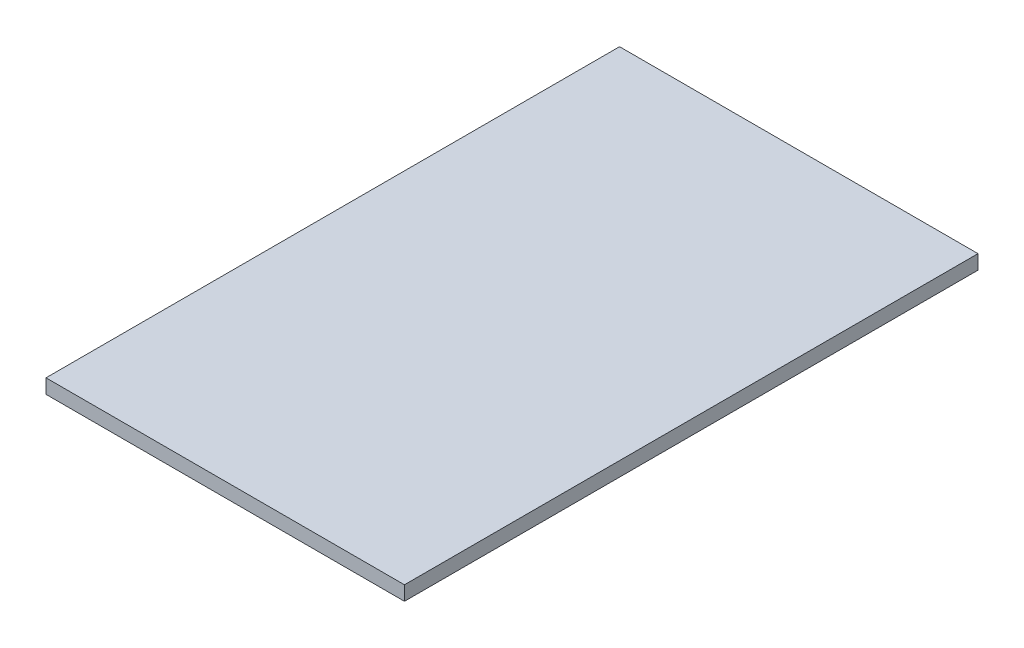
ISO-10303-21;
HEADER;
FILE_DESCRIPTION(('STEP AP214'),'2;1');
FILE_NAME('part.step','',(''),(''),'','','');
FILE_SCHEMA(('AUTOMOTIVE_DESIGN { 1 0 10303 214 1 1 1 1 }'));
ENDSEC;
DATA;
#1=APPLICATION_CONTEXT('core data for automotive mechanical design processes');
#2=APPLICATION_PROTOCOL_DEFINITION('international standard','automotive_design',2000,#1);
#3=PRODUCT_CONTEXT('',#1,'mechanical');
#4=PRODUCT('Part','Part','',(#3));
#5=PRODUCT_RELATED_PRODUCT_CATEGORY('part','',(#4));
#6=PRODUCT_DEFINITION_FORMATION('','',#4);
#7=PRODUCT_DEFINITION_CONTEXT('part definition',#1,'design');
#8=PRODUCT_DEFINITION('design','',#6,#7);
#9=PRODUCT_DEFINITION_SHAPE('','',#8);
#10=(LENGTH_UNIT() NAMED_UNIT(*) SI_UNIT(.MILLI.,.METRE.));
#11=(NAMED_UNIT(*) PLANE_ANGLE_UNIT() SI_UNIT($,.RADIAN.));
#12=(NAMED_UNIT(*) SI_UNIT($,.STERADIAN.) SOLID_ANGLE_UNIT());
#13=UNCERTAINTY_MEASURE_WITH_UNIT(LENGTH_MEASURE(1.E-05),#10,'distance_accuracy_value','');
#14=(GEOMETRIC_REPRESENTATION_CONTEXT(3) GLOBAL_UNCERTAINTY_ASSIGNED_CONTEXT((#13)) GLOBAL_UNIT_ASSIGNED_CONTEXT((#10,
#11,#12)) REPRESENTATION_CONTEXT('',''));
#15=CARTESIAN_POINT('',(0.,0.,0.));
#16=DIRECTION('',(0.,0.,1.));
#17=DIRECTION('',(1.,0.,0.));
#18=AXIS2_PLACEMENT_3D('',#15,#16,#17);
#19=CARTESIAN_POINT('',(25.,2.,40.));
#20=DIRECTION('',(-1.,0.,0.));
#21=DIRECTION('',(0.,0.,1.));
#22=AXIS2_PLACEMENT_3D('',#19,#20,#21);
#23=PLANE('',#22);
#24=DIRECTION('',(0.,0.,-1.));
#25=VECTOR('',#24,1.);
#26=CARTESIAN_POINT('',(25.,0.,40.));
#27=LINE('',#26,#25);
#28=CARTESIAN_POINT('',(25.,0.,40.));
#29=VERTEX_POINT('',#28);
#30=CARTESIAN_POINT('',(25.,0.,-40.));
#31=VERTEX_POINT('',#30);
#32=EDGE_CURVE('E96',#29,#31,#27,.T.);
#33=ORIENTED_EDGE('',*,*,#32,.T.);
#34=DIRECTION('',(0.,-1.,0.));
#35=VECTOR('',#34,1.);
#36=CARTESIAN_POINT('',(25.,2.,-40.));
#37=LINE('',#36,#35);
#38=CARTESIAN_POINT('',(25.,2.,-40.));
#39=VERTEX_POINT('',#38);
#40=EDGE_CURVE('E11',#39,#31,#37,.T.);
#41=ORIENTED_EDGE('',*,*,#40,.F.);
#42=DIRECTION('',(0.,0.,-1.));
#43=VECTOR('',#42,1.);
#44=CARTESIAN_POINT('',(25.,2.,40.));
#45=LINE('',#44,#43);
#46=CARTESIAN_POINT('',(25.,2.,40.));
#47=VERTEX_POINT('',#46);
#48=EDGE_CURVE('E84',#47,#39,#45,.T.);
#49=ORIENTED_EDGE('',*,*,#48,.F.);
#50=DIRECTION('',(0.,-1.,0.));
#51=VECTOR('',#50,1.);
#52=CARTESIAN_POINT('',(25.,2.,40.));
#53=LINE('',#52,#51);
#54=EDGE_CURVE('E92',#47,#29,#53,.T.);
#55=ORIENTED_EDGE('',*,*,#54,.T.);
#56=EDGE_LOOP('',(#33,#41,#49,#55));
#57=FACE_BOUND('',#56,.T.);
#58=ADVANCED_FACE('F33',(#57),#23,.F.);
#59=CARTESIAN_POINT('',(-25.,2.,-40.));
#60=DIRECTION('',(0.,0.,1.));
#61=DIRECTION('',(1.,0.,0.));
#62=AXIS2_PLACEMENT_3D('',#59,#60,#61);
#63=PLANE('',#62);
#64=DIRECTION('',(-1.,0.,0.));
#65=VECTOR('',#64,1.);
#66=CARTESIAN_POINT('',(-25.,0.,-40.));
#67=LINE('',#66,#65);
#68=CARTESIAN_POINT('',(-25.,0.,-40.));
#69=VERTEX_POINT('',#68);
#70=EDGE_CURVE('E88',#31,#69,#67,.T.);
#71=ORIENTED_EDGE('',*,*,#70,.T.);
#72=DIRECTION('',(0.,-1.,0.));
#73=VECTOR('',#72,1.);
#74=CARTESIAN_POINT('',(-25.,2.,-40.));
#75=LINE('',#74,#73);
#76=CARTESIAN_POINT('',(-25.,2.,-40.));
#77=VERTEX_POINT('',#76);
#78=EDGE_CURVE('E41',#77,#69,#75,.T.);
#79=ORIENTED_EDGE('',*,*,#78,.F.);
#80=DIRECTION('',(-1.,0.,0.));
#81=VECTOR('',#80,1.);
#82=CARTESIAN_POINT('',(-25.,2.,-40.));
#83=LINE('',#82,#81);
#84=EDGE_CURVE('E79',#39,#77,#83,.T.);
#85=ORIENTED_EDGE('',*,*,#84,.F.);
#86=ORIENTED_EDGE('',*,*,#40,.T.);
#87=EDGE_LOOP('',(#71,#79,#85,#86));
#88=FACE_BOUND('',#87,.T.);
#89=ADVANCED_FACE('F87',(#88),#63,.F.);
#90=CARTESIAN_POINT('',(-25.,2.,40.));
#91=DIRECTION('',(1.,0.,0.));
#92=DIRECTION('',(0.,0.,-1.));
#93=AXIS2_PLACEMENT_3D('',#90,#91,#92);
#94=PLANE('',#93);
#95=DIRECTION('',(0.,0.,1.));
#96=VECTOR('',#95,1.);
#97=CARTESIAN_POINT('',(-25.,0.,40.));
#98=LINE('',#97,#96);
#99=CARTESIAN_POINT('',(-25.,0.,40.));
#100=VERTEX_POINT('',#99);
#101=EDGE_CURVE('E66',#69,#100,#98,.T.);
#102=ORIENTED_EDGE('',*,*,#101,.T.);
#103=DIRECTION('',(0.,-1.,0.));
#104=VECTOR('',#103,1.);
#105=CARTESIAN_POINT('',(-25.,2.,40.));
#106=LINE('',#105,#104);
#107=CARTESIAN_POINT('',(-25.,2.,40.));
#108=VERTEX_POINT('',#107);
#109=EDGE_CURVE('E89',#108,#100,#106,.T.);
#110=ORIENTED_EDGE('',*,*,#109,.F.);
#111=DIRECTION('',(0.,0.,1.));
#112=VECTOR('',#111,1.);
#113=CARTESIAN_POINT('',(-25.,2.,40.));
#114=LINE('',#113,#112);
#115=EDGE_CURVE('E82',#77,#108,#114,.T.);
#116=ORIENTED_EDGE('',*,*,#115,.F.);
#117=ORIENTED_EDGE('',*,*,#78,.T.);
#118=EDGE_LOOP('',(#102,#110,#116,#117));
#119=FACE_BOUND('',#118,.T.);
#120=ADVANCED_FACE('F90',(#119),#94,.F.);
#121=CARTESIAN_POINT('',(-25.,2.,40.));
#122=DIRECTION('',(0.,0.,-1.));
#123=DIRECTION('',(-1.,0.,0.));
#124=AXIS2_PLACEMENT_3D('',#121,#122,#123);
#125=PLANE('',#124);
#126=DIRECTION('',(1.,0.,0.));
#127=VECTOR('',#126,1.);
#128=CARTESIAN_POINT('',(-25.,0.,40.));
#129=LINE('',#128,#127);
#130=EDGE_CURVE('E72',#100,#29,#129,.T.);
#131=ORIENTED_EDGE('',*,*,#130,.T.);
#132=ORIENTED_EDGE('',*,*,#54,.F.);
#133=DIRECTION('',(1.,0.,0.));
#134=VECTOR('',#133,1.);
#135=CARTESIAN_POINT('',(-25.,2.,40.));
#136=LINE('',#135,#134);
#137=EDGE_CURVE('E49',#108,#47,#136,.T.);
#138=ORIENTED_EDGE('',*,*,#137,.F.);
#139=ORIENTED_EDGE('',*,*,#109,.T.);
#140=EDGE_LOOP('',(#131,#132,#138,#139));
#141=FACE_BOUND('',#140,.T.);
#142=ADVANCED_FACE('F103',(#141),#125,.F.);
#143=CARTESIAN_POINT('',(0.,2.,0.));
#144=DIRECTION('',(0.,-1.,0.));
#145=DIRECTION('',(0.,0.,-1.));
#146=AXIS2_PLACEMENT_3D('',#143,#144,#145);
#147=PLANE('',#146);
#148=ORIENTED_EDGE('',*,*,#48,.T.);
#149=ORIENTED_EDGE('',*,*,#84,.T.);
#150=ORIENTED_EDGE('',*,*,#115,.T.);
#151=ORIENTED_EDGE('',*,*,#137,.T.);
#152=EDGE_LOOP('',(#148,#149,#150,#151));
#153=FACE_BOUND('',#152,.T.);
#154=ADVANCED_FACE('F80',(#153),#147,.F.);
#155=CARTESIAN_POINT('',(0.,0.,0.));
#156=DIRECTION('',(0.,-1.,0.));
#157=DIRECTION('',(0.,0.,-1.));
#158=AXIS2_PLACEMENT_3D('',#155,#156,#157);
#159=PLANE('',#158);
#160=ORIENTED_EDGE('',*,*,#32,.F.);
#161=ORIENTED_EDGE('',*,*,#130,.F.);
#162=ORIENTED_EDGE('',*,*,#101,.F.);
#163=ORIENTED_EDGE('',*,*,#70,.F.);
#164=EDGE_LOOP('',(#160,#161,#162,#163));
#165=FACE_BOUND('',#164,.T.);
#166=ADVANCED_FACE('F106',(#165),#159,.T.);
#167=CLOSED_SHELL('',(#58,#89,#120,#142,#154,#166));
#168=MANIFOLD_SOLID_BREP('B2',#167);
#169=ADVANCED_BREP_SHAPE_REPRESENTATION('',(#18,#168),#14);
#170=SHAPE_DEFINITION_REPRESENTATION(#9,#169);
ENDSEC;
END-ISO-10303-21;
